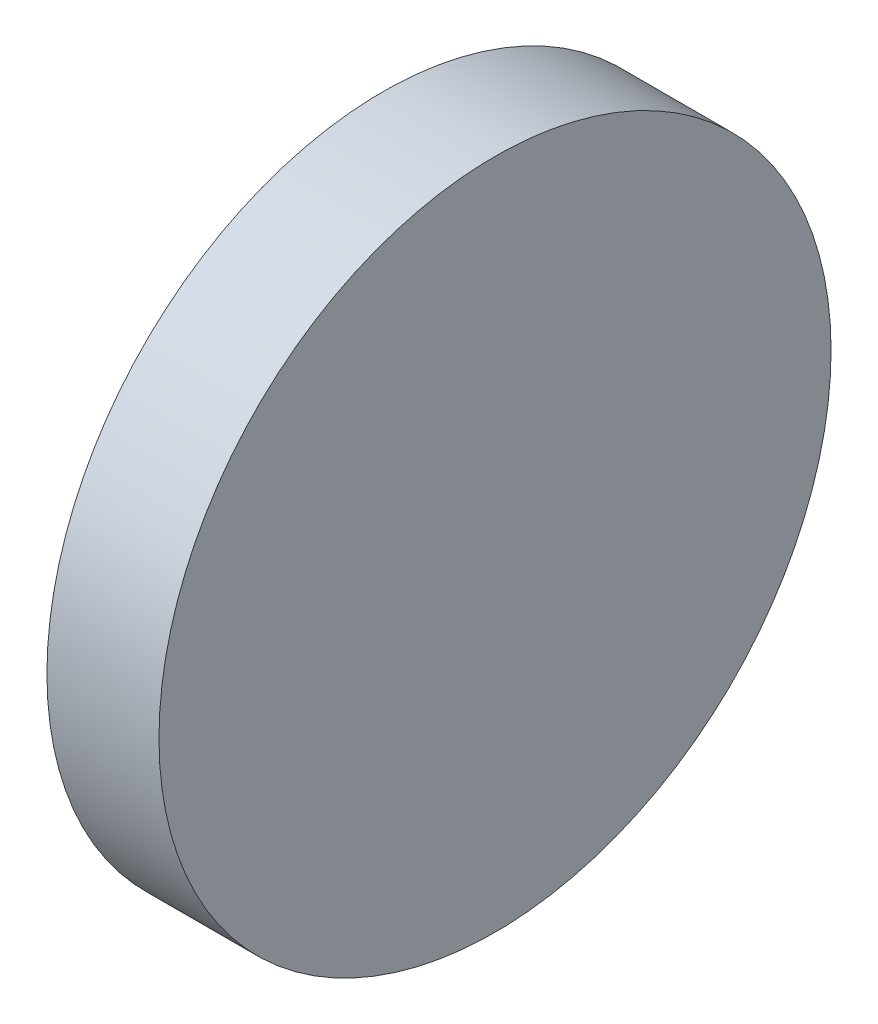
ISO-10303-21;
HEADER;
FILE_DESCRIPTION(('STEP AP214'),'2;1');
FILE_NAME('part.step','',(''),(''),'','','');
FILE_SCHEMA(('AUTOMOTIVE_DESIGN { 1 0 10303 214 1 1 1 1 }'));
ENDSEC;
DATA;
#1=APPLICATION_CONTEXT('core data for automotive mechanical design processes');
#2=APPLICATION_PROTOCOL_DEFINITION('international standard','automotive_design',2000,#1);
#3=PRODUCT_CONTEXT('',#1,'mechanical');
#4=PRODUCT('Part','Part','',(#3));
#5=PRODUCT_RELATED_PRODUCT_CATEGORY('part','',(#4));
#6=PRODUCT_DEFINITION_FORMATION('','',#4);
#7=PRODUCT_DEFINITION_CONTEXT('part definition',#1,'design');
#8=PRODUCT_DEFINITION('design','',#6,#7);
#9=PRODUCT_DEFINITION_SHAPE('','',#8);
#10=(LENGTH_UNIT() NAMED_UNIT(*) SI_UNIT(.MILLI.,.METRE.));
#11=(NAMED_UNIT(*) PLANE_ANGLE_UNIT() SI_UNIT($,.RADIAN.));
#12=(NAMED_UNIT(*) SI_UNIT($,.STERADIAN.) SOLID_ANGLE_UNIT());
#13=UNCERTAINTY_MEASURE_WITH_UNIT(LENGTH_MEASURE(1.E-05),#10,'distance_accuracy_value','');
#14=(GEOMETRIC_REPRESENTATION_CONTEXT(3) GLOBAL_UNCERTAINTY_ASSIGNED_CONTEXT((#13)) GLOBAL_UNIT_ASSIGNED_CONTEXT((#10,
#11,#12)) REPRESENTATION_CONTEXT('',''));
#15=CARTESIAN_POINT('',(0.,0.,0.));
#16=DIRECTION('',(0.,0.,1.));
#17=DIRECTION('',(1.,0.,0.));
#18=AXIS2_PLACEMENT_3D('',#15,#16,#17);
#19=CARTESIAN_POINT('',(5.,0.,0.));
#20=DIRECTION('',(-1.,0.,0.));
#21=DIRECTION('',(0.,0.,1.));
#22=AXIS2_PLACEMENT_3D('',#19,#20,#21);
#23=CYLINDRICAL_SURFACE('',#22,15.);
#24=CARTESIAN_POINT('',(5.,0.,0.));
#25=DIRECTION('',(1.,0.,0.));
#26=DIRECTION('',(0.,0.,-1.));
#27=AXIS2_PLACEMENT_3D('',#24,#25,#26);
#28=CIRCLE('',#27,15.);
#29=CARTESIAN_POINT('',(5.,0.,-15.));
#30=VERTEX_POINT('',#29);
#31=EDGE_CURVE('E10',#30,#30,#28,.T.);
#32=ORIENTED_EDGE('',*,*,#31,.F.);
#33=EDGE_LOOP('',(#32));
#34=FACE_BOUND('',#33,.T.);
#35=CARTESIAN_POINT('',(0.,0.,0.));
#36=DIRECTION('',(1.,0.,0.));
#37=DIRECTION('',(0.,0.,-1.));
#38=AXIS2_PLACEMENT_3D('',#35,#36,#37);
#39=CIRCLE('',#38,15.);
#40=CARTESIAN_POINT('',(0.,0.,-15.));
#41=VERTEX_POINT('',#40);
#42=EDGE_CURVE('E37',#41,#41,#39,.T.);
#43=ORIENTED_EDGE('',*,*,#42,.T.);
#44=EDGE_LOOP('',(#43));
#45=FACE_BOUND('',#44,.T.);
#46=ADVANCED_FACE('F34',(#34,#45),#23,.T.);
#47=CARTESIAN_POINT('',(5.,0.,0.));
#48=DIRECTION('',(1.,0.,0.));
#49=DIRECTION('',(0.,0.,-1.));
#50=AXIS2_PLACEMENT_3D('',#47,#48,#49);
#51=PLANE('',#50);
#52=ORIENTED_EDGE('',*,*,#31,.T.);
#53=EDGE_LOOP('',(#52));
#54=FACE_BOUND('',#53,.T.);
#55=ADVANCED_FACE('F49',(#54),#51,.T.);
#56=CARTESIAN_POINT('',(0.,0.,0.));
#57=DIRECTION('',(1.,0.,0.));
#58=DIRECTION('',(0.,0.,-1.));
#59=AXIS2_PLACEMENT_3D('',#56,#57,#58);
#60=PLANE('',#59);
#61=ORIENTED_EDGE('',*,*,#42,.F.);
#62=EDGE_LOOP('',(#61));
#63=FACE_BOUND('',#62,.T.);
#64=ADVANCED_FACE('F47',(#63),#60,.F.);
#65=CLOSED_SHELL('',(#46,#55,#64));
#66=MANIFOLD_SOLID_BREP('B2',#65);
#67=ADVANCED_BREP_SHAPE_REPRESENTATION('',(#18,#66),#14);
#68=SHAPE_DEFINITION_REPRESENTATION(#9,#67);
ENDSEC;
END-ISO-10303-21;
